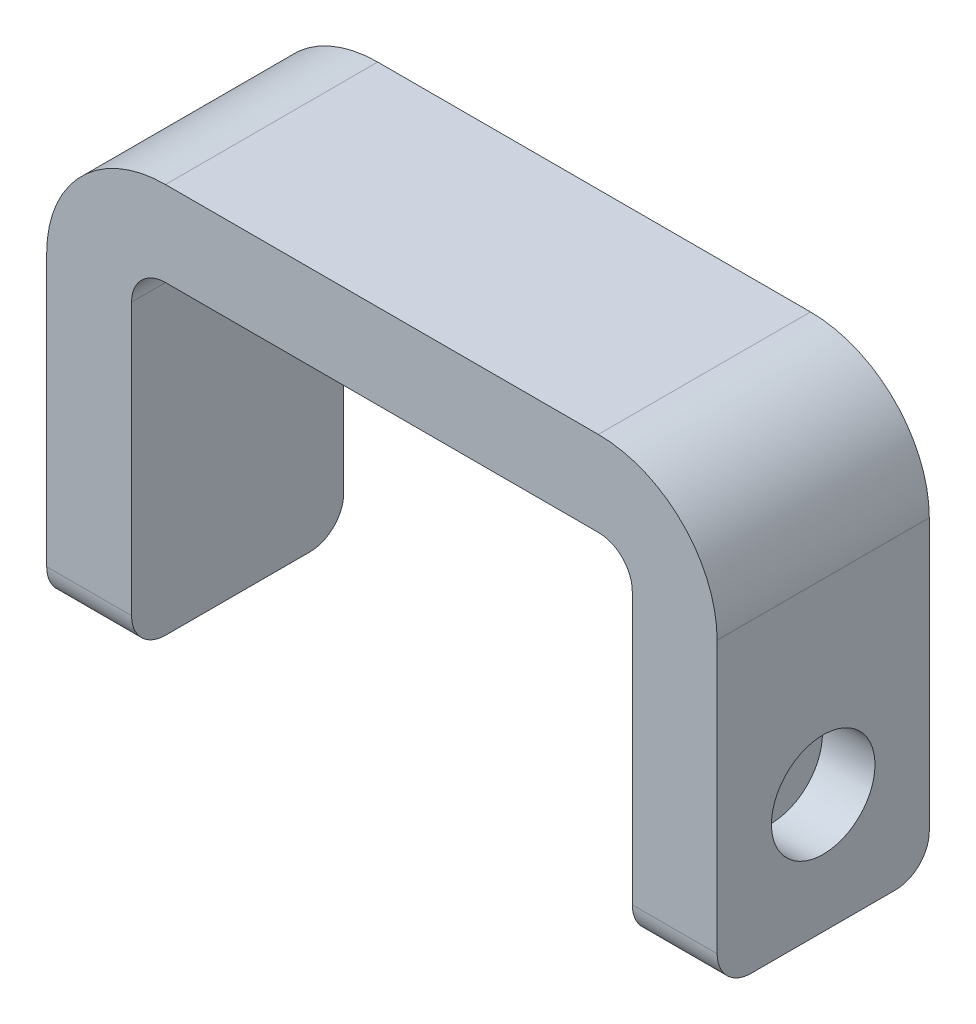
ISO-10303-21;
HEADER;
FILE_DESCRIPTION(('STEP AP214'),'2;1');
FILE_NAME('part.step','',(''),(''),'','','');
FILE_SCHEMA(('AUTOMOTIVE_DESIGN { 1 0 10303 214 1 1 1 1 }'));
ENDSEC;
DATA;
#1=APPLICATION_CONTEXT('core data for automotive mechanical design processes');
#2=APPLICATION_PROTOCOL_DEFINITION('international standard','automotive_design',2000,#1);
#3=PRODUCT_CONTEXT('',#1,'mechanical');
#4=PRODUCT('Part','Part','',(#3));
#5=PRODUCT_RELATED_PRODUCT_CATEGORY('part','',(#4));
#6=PRODUCT_DEFINITION_FORMATION('','',#4);
#7=PRODUCT_DEFINITION_CONTEXT('part definition',#1,'design');
#8=PRODUCT_DEFINITION('design','',#6,#7);
#9=PRODUCT_DEFINITION_SHAPE('','',#8);
#10=(LENGTH_UNIT() NAMED_UNIT(*) SI_UNIT(.MILLI.,.METRE.));
#11=(NAMED_UNIT(*) PLANE_ANGLE_UNIT() SI_UNIT($,.RADIAN.));
#12=(NAMED_UNIT(*) SI_UNIT($,.STERADIAN.) SOLID_ANGLE_UNIT());
#13=UNCERTAINTY_MEASURE_WITH_UNIT(LENGTH_MEASURE(1.E-05),#10,'distance_accuracy_value','');
#14=(GEOMETRIC_REPRESENTATION_CONTEXT(3) GLOBAL_UNCERTAINTY_ASSIGNED_CONTEXT((#13)) GLOBAL_UNIT_ASSIGNED_CONTEXT((#10,
#11,#12)) REPRESENTATION_CONTEXT('',''));
#15=CARTESIAN_POINT('',(0.,0.,0.));
#16=DIRECTION('',(0.,0.,1.));
#17=DIRECTION('',(1.,0.,0.));
#18=AXIS2_PLACEMENT_3D('',#15,#16,#17);
#19=CARTESIAN_POINT('',(-14.75,0.,6.25));
#20=DIRECTION('',(-1.,0.,0.));
#21=DIRECTION('',(0.,0.,1.));
#22=AXIS2_PLACEMENT_3D('',#19,#20,#21);
#23=PLANE('',#22);
#24=DIRECTION('',(0.,0.,-1.));
#25=VECTOR('',#24,1.);
#26=CARTESIAN_POINT('',(-14.75,0.,6.25));
#27=LINE('',#26,#25);
#28=CARTESIAN_POINT('',(-14.75,0.,4.25));
#29=VERTEX_POINT('',#28);
#30=CARTESIAN_POINT('',(-14.75,0.,-4.25));
#31=VERTEX_POINT('',#30);
#32=EDGE_CURVE('E198',#29,#31,#27,.T.);
#33=ORIENTED_EDGE('',*,*,#32,.T.);
#34=CARTESIAN_POINT('',(-14.75,2.,-4.25));
#35=DIRECTION('',(-1.,0.,0.));
#36=DIRECTION('',(0.,0.,1.));
#37=AXIS2_PLACEMENT_3D('',#34,#35,#36);
#38=CIRCLE('',#37,2.);
#39=CARTESIAN_POINT('',(-14.75,2.,-6.25));
#40=VERTEX_POINT('',#39);
#41=EDGE_CURVE('E268',#31,#40,#38,.F.);
#42=ORIENTED_EDGE('',*,*,#41,.T.);
#43=DIRECTION('',(0.,1.,0.));
#44=VECTOR('',#43,1.);
#45=CARTESIAN_POINT('',(-14.75,0.,-6.25));
#46=LINE('',#45,#44);
#47=CARTESIAN_POINT('',(-14.75,18.,-6.25));
#48=VERTEX_POINT('',#47);
#49=EDGE_CURVE('E189',#40,#48,#46,.T.);
#50=ORIENTED_EDGE('',*,*,#49,.T.);
#51=DIRECTION('',(0.,0.,-1.));
#52=VECTOR('',#51,1.);
#53=CARTESIAN_POINT('',(-14.75,18.,6.25));
#54=LINE('',#53,#52);
#55=CARTESIAN_POINT('',(-14.75,18.,6.25));
#56=VERTEX_POINT('',#55);
#57=EDGE_CURVE('E167',#48,#56,#54,.F.);
#58=ORIENTED_EDGE('',*,*,#57,.T.);
#59=DIRECTION('',(0.,1.,0.));
#60=VECTOR('',#59,1.);
#61=CARTESIAN_POINT('',(-14.75,0.,6.25));
#62=LINE('',#61,#60);
#63=CARTESIAN_POINT('',(-14.75,2.,6.25));
#64=VERTEX_POINT('',#63);
#65=EDGE_CURVE('E197',#64,#56,#62,.T.);
#66=ORIENTED_EDGE('',*,*,#65,.F.);
#67=CARTESIAN_POINT('',(-14.75,2.,4.25));
#68=DIRECTION('',(-1.,0.,0.));
#69=DIRECTION('',(0.,0.,1.));
#70=AXIS2_PLACEMENT_3D('',#67,#68,#69);
#71=CIRCLE('',#70,2.);
#72=EDGE_CURVE('E266',#64,#29,#71,.F.);
#73=ORIENTED_EDGE('',*,*,#72,.T.);
#74=EDGE_LOOP('',(#33,#42,#50,#58,#66,#73));
#75=FACE_BOUND('',#74,.T.);
#76=ADVANCED_FACE('F43',(#75),#23,.F.);
#77=CARTESIAN_POINT('',(-14.75,20.,6.25));
#78=DIRECTION('',(0.,1.,0.));
#79=DIRECTION('',(0.,0.,1.));
#80=AXIS2_PLACEMENT_3D('',#77,#78,#79);
#81=PLANE('',#80);
#82=DIRECTION('',(1.,0.,0.));
#83=VECTOR('',#82,1.);
#84=CARTESIAN_POINT('',(-14.75,20.,-6.25));
#85=LINE('',#84,#83);
#86=CARTESIAN_POINT('',(-12.75,20.,-6.25));
#87=VERTEX_POINT('',#86);
#88=CARTESIAN_POINT('',(12.75,20.,-6.25));
#89=VERTEX_POINT('',#88);
#90=EDGE_CURVE('E185',#87,#89,#85,.T.);
#91=ORIENTED_EDGE('',*,*,#90,.T.);
#92=DIRECTION('',(0.,0.,-1.));
#93=VECTOR('',#92,1.);
#94=CARTESIAN_POINT('',(12.75,20.,6.25));
#95=LINE('',#94,#93);
#96=CARTESIAN_POINT('',(12.75,20.,6.25));
#97=VERTEX_POINT('',#96);
#98=EDGE_CURVE('E161',#89,#97,#95,.F.);
#99=ORIENTED_EDGE('',*,*,#98,.T.);
#100=DIRECTION('',(1.,0.,0.));
#101=VECTOR('',#100,1.);
#102=CARTESIAN_POINT('',(-14.75,20.,6.25));
#103=LINE('',#102,#101);
#104=CARTESIAN_POINT('',(-12.75,20.,6.25));
#105=VERTEX_POINT('',#104);
#106=EDGE_CURVE('E301',#105,#97,#103,.T.);
#107=ORIENTED_EDGE('',*,*,#106,.F.);
#108=DIRECTION('',(0.,0.,-1.));
#109=VECTOR('',#108,1.);
#110=CARTESIAN_POINT('',(-12.75,20.,-6.25));
#111=LINE('',#110,#109);
#112=EDGE_CURVE('E177',#105,#87,#111,.T.);
#113=ORIENTED_EDGE('',*,*,#112,.T.);
#114=EDGE_LOOP('',(#91,#99,#107,#113));
#115=FACE_BOUND('',#114,.T.);
#116=ADVANCED_FACE('F330',(#115),#81,.F.);
#117=CARTESIAN_POINT('',(14.75,0.,6.25));
#118=DIRECTION('',(1.,0.,0.));
#119=DIRECTION('',(0.,0.,-1.));
#120=AXIS2_PLACEMENT_3D('',#117,#118,#119);
#121=PLANE('',#120);
#122=DIRECTION('',(0.,-1.,0.));
#123=VECTOR('',#122,1.);
#124=CARTESIAN_POINT('',(14.75,0.,-6.25));
#125=LINE('',#124,#123);
#126=CARTESIAN_POINT('',(14.75,18.,-6.25));
#127=VERTEX_POINT('',#126);
#128=CARTESIAN_POINT('',(14.75,2.,-6.25));
#129=VERTEX_POINT('',#128);
#130=EDGE_CURVE('E173',#127,#129,#125,.T.);
#131=ORIENTED_EDGE('',*,*,#130,.T.);
#132=CARTESIAN_POINT('',(14.75,2.,-4.25));
#133=DIRECTION('',(1.,0.,0.));
#134=DIRECTION('',(0.,0.,-1.));
#135=AXIS2_PLACEMENT_3D('',#132,#133,#134);
#136=CIRCLE('',#135,2.);
#137=CARTESIAN_POINT('',(14.75,0.,-4.25));
#138=VERTEX_POINT('',#137);
#139=EDGE_CURVE('E254',#129,#138,#136,.F.);
#140=ORIENTED_EDGE('',*,*,#139,.T.);
#141=DIRECTION('',(0.,0.,-1.));
#142=VECTOR('',#141,1.);
#143=CARTESIAN_POINT('',(14.75,0.,6.25));
#144=LINE('',#143,#142);
#145=CARTESIAN_POINT('',(14.75,0.,4.25));
#146=VERTEX_POINT('',#145);
#147=EDGE_CURVE('E178',#146,#138,#144,.T.);
#148=ORIENTED_EDGE('',*,*,#147,.F.);
#149=CARTESIAN_POINT('',(14.75,2.,4.25));
#150=DIRECTION('',(1.,0.,0.));
#151=DIRECTION('',(0.,0.,-1.));
#152=AXIS2_PLACEMENT_3D('',#149,#150,#151);
#153=CIRCLE('',#152,2.);
#154=CARTESIAN_POINT('',(14.75,2.,6.25));
#155=VERTEX_POINT('',#154);
#156=EDGE_CURVE('E252',#146,#155,#153,.F.);
#157=ORIENTED_EDGE('',*,*,#156,.T.);
#158=DIRECTION('',(0.,-1.,0.));
#159=VECTOR('',#158,1.);
#160=CARTESIAN_POINT('',(14.75,0.,6.25));
#161=LINE('',#160,#159);
#162=CARTESIAN_POINT('',(14.75,18.,6.25));
#163=VERTEX_POINT('',#162);
#164=EDGE_CURVE('E176',#163,#155,#161,.T.);
#165=ORIENTED_EDGE('',*,*,#164,.F.);
#166=DIRECTION('',(0.,0.,-1.));
#167=VECTOR('',#166,1.);
#168=CARTESIAN_POINT('',(14.75,18.,-6.25));
#169=LINE('',#168,#167);
#170=EDGE_CURVE('E160',#163,#127,#169,.T.);
#171=ORIENTED_EDGE('',*,*,#170,.T.);
#172=EDGE_LOOP('',(#131,#140,#148,#157,#165,#171));
#173=FACE_BOUND('',#172,.T.);
#174=ADVANCED_FACE('F172',(#173),#121,.F.);
#175=CARTESIAN_POINT('',(14.75,0.,6.25));
#176=DIRECTION('',(0.,1.,0.));
#177=DIRECTION('',(-1.,0.,0.));
#178=AXIS2_PLACEMENT_3D('',#175,#176,#177);
#179=PLANE('',#178);
#180=ORIENTED_EDGE('',*,*,#147,.T.);
#181=DIRECTION('',(1.,0.,0.));
#182=VECTOR('',#181,1.);
#183=CARTESIAN_POINT('',(19.75,0.,-4.25));
#184=LINE('',#183,#182);
#185=CARTESIAN_POINT('',(19.75,0.,-4.25));
#186=VERTEX_POINT('',#185);
#187=EDGE_CURVE('E242',#138,#186,#184,.T.);
#188=ORIENTED_EDGE('',*,*,#187,.T.);
#189=DIRECTION('',(0.,0.,-1.));
#190=VECTOR('',#189,1.);
#191=CARTESIAN_POINT('',(19.75,0.,6.25));
#192=LINE('',#191,#190);
#193=CARTESIAN_POINT('',(19.75,0.,4.25));
#194=VERTEX_POINT('',#193);
#195=EDGE_CURVE('E204',#194,#186,#192,.T.);
#196=ORIENTED_EDGE('',*,*,#195,.F.);
#197=DIRECTION('',(1.,0.,0.));
#198=VECTOR('',#197,1.);
#199=CARTESIAN_POINT('',(14.75,0.,4.25));
#200=LINE('',#199,#198);
#201=EDGE_CURVE('E240',#194,#146,#200,.F.);
#202=ORIENTED_EDGE('',*,*,#201,.T.);
#203=EDGE_LOOP('',(#180,#188,#196,#202));
#204=FACE_BOUND('',#203,.T.);
#205=ADVANCED_FACE('F486',(#204),#179,.F.);
#206=CARTESIAN_POINT('',(19.75,0.,6.25));
#207=DIRECTION('',(-1.,0.,0.));
#208=DIRECTION('',(0.,0.,1.));
#209=AXIS2_PLACEMENT_3D('',#206,#207,#208);
#210=PLANE('',#209);
#211=CARTESIAN_POINT('',(19.75,7.,0.));
#212=DIRECTION('',(-1.,0.,0.));
#213=DIRECTION('',(0.,0.,1.));
#214=AXIS2_PLACEMENT_3D('',#211,#212,#213);
#215=CIRCLE('',#214,3.05);
#216=CARTESIAN_POINT('',(19.75,7.,3.05));
#217=VERTEX_POINT('',#216);
#218=EDGE_CURVE('E308',#217,#217,#215,.T.);
#219=ORIENTED_EDGE('',*,*,#218,.T.);
#220=EDGE_LOOP('',(#219));
#221=FACE_BOUND('',#220,.T.);
#222=ORIENTED_EDGE('',*,*,#195,.T.);
#223=CARTESIAN_POINT('',(19.75,2.,-4.25));
#224=DIRECTION('',(-1.,0.,0.));
#225=DIRECTION('',(0.,0.,1.));
#226=AXIS2_PLACEMENT_3D('',#223,#224,#225);
#227=CIRCLE('',#226,2.);
#228=CARTESIAN_POINT('',(19.75,2.,-6.25));
#229=VERTEX_POINT('',#228);
#230=EDGE_CURVE('E247',#186,#229,#227,.F.);
#231=ORIENTED_EDGE('',*,*,#230,.T.);
#232=DIRECTION('',(0.,1.,0.));
#233=VECTOR('',#232,1.);
#234=CARTESIAN_POINT('',(19.75,0.,-6.25));
#235=LINE('',#234,#233);
#236=CARTESIAN_POINT('',(19.75,18.,-6.25));
#237=VERTEX_POINT('',#236);
#238=EDGE_CURVE('E184',#229,#237,#235,.T.);
#239=ORIENTED_EDGE('',*,*,#238,.T.);
#240=DIRECTION('',(0.,0.,-1.));
#241=VECTOR('',#240,1.);
#242=CARTESIAN_POINT('',(19.75,18.,6.25));
#243=LINE('',#242,#241);
#244=CARTESIAN_POINT('',(19.75,18.,6.25));
#245=VERTEX_POINT('',#244);
#246=EDGE_CURVE('E230',#237,#245,#243,.F.);
#247=ORIENTED_EDGE('',*,*,#246,.T.);
#248=DIRECTION('',(0.,1.,0.));
#249=VECTOR('',#248,1.);
#250=CARTESIAN_POINT('',(19.75,0.,6.25));
#251=LINE('',#250,#249);
#252=CARTESIAN_POINT('',(19.75,2.,6.25));
#253=VERTEX_POINT('',#252);
#254=EDGE_CURVE('E298',#253,#245,#251,.T.);
#255=ORIENTED_EDGE('',*,*,#254,.F.);
#256=CARTESIAN_POINT('',(19.75,2.,4.25));
#257=DIRECTION('',(-1.,0.,0.));
#258=DIRECTION('',(0.,0.,1.));
#259=AXIS2_PLACEMENT_3D('',#256,#257,#258);
#260=CIRCLE('',#259,2.);
#261=EDGE_CURVE('E245',#253,#194,#260,.F.);
#262=ORIENTED_EDGE('',*,*,#261,.T.);
#263=EDGE_LOOP('',(#222,#231,#239,#247,#255,#262));
#264=FACE_BOUND('',#263,.T.);
#265=ADVANCED_FACE('F477',(#221,#264),#210,.F.);
#266=CARTESIAN_POINT('',(-19.75,25.,6.25));
#267=DIRECTION('',(0.,-1.,0.));
#268=DIRECTION('',(0.,0.,-1.));
#269=AXIS2_PLACEMENT_3D('',#266,#267,#268);
#270=PLANE('',#269);
#271=DIRECTION('',(-1.,0.,0.));
#272=VECTOR('',#271,1.);
#273=CARTESIAN_POINT('',(-19.75,25.,6.25));
#274=LINE('',#273,#272);
#275=CARTESIAN_POINT('',(12.75,25.,6.25));
#276=VERTEX_POINT('',#275);
#277=CARTESIAN_POINT('',(-12.75,25.,6.25));
#278=VERTEX_POINT('',#277);
#279=EDGE_CURVE('E281',#276,#278,#274,.T.);
#280=ORIENTED_EDGE('',*,*,#279,.F.);
#281=DIRECTION('',(0.,0.,-1.));
#282=VECTOR('',#281,1.);
#283=CARTESIAN_POINT('',(12.75,25.,6.25));
#284=LINE('',#283,#282);
#285=CARTESIAN_POINT('',(12.75,25.,-6.25));
#286=VERTEX_POINT('',#285);
#287=EDGE_CURVE('E222',#276,#286,#284,.T.);
#288=ORIENTED_EDGE('',*,*,#287,.T.);
#289=DIRECTION('',(-1.,0.,0.));
#290=VECTOR('',#289,1.);
#291=CARTESIAN_POINT('',(-19.75,25.,-6.25));
#292=LINE('',#291,#290);
#293=CARTESIAN_POINT('',(-12.75,25.,-6.25));
#294=VERTEX_POINT('',#293);
#295=EDGE_CURVE('E187',#286,#294,#292,.T.);
#296=ORIENTED_EDGE('',*,*,#295,.T.);
#297=DIRECTION('',(0.,0.,-1.));
#298=VECTOR('',#297,1.);
#299=CARTESIAN_POINT('',(-12.75,25.,6.25));
#300=LINE('',#299,#298);
#301=EDGE_CURVE('E220',#294,#278,#300,.F.);
#302=ORIENTED_EDGE('',*,*,#301,.T.);
#303=EDGE_LOOP('',(#280,#288,#296,#302));
#304=FACE_BOUND('',#303,.T.);
#305=ADVANCED_FACE('F467',(#304),#270,.F.);
#306=CARTESIAN_POINT('',(-19.75,0.,6.25));
#307=DIRECTION('',(1.,0.,0.));
#308=DIRECTION('',(0.,0.,-1.));
#309=AXIS2_PLACEMENT_3D('',#306,#307,#308);
#310=PLANE('',#309);
#311=CARTESIAN_POINT('',(-19.75,7.,0.));
#312=DIRECTION('',(-1.,0.,0.));
#313=DIRECTION('',(0.,0.,1.));
#314=AXIS2_PLACEMENT_3D('',#311,#312,#313);
#315=CIRCLE('',#314,3.05);
#316=CARTESIAN_POINT('',(-19.75,7.,3.05));
#317=VERTEX_POINT('',#316);
#318=EDGE_CURVE('E294',#317,#317,#315,.T.);
#319=ORIENTED_EDGE('',*,*,#318,.F.);
#320=EDGE_LOOP('',(#319));
#321=FACE_BOUND('',#320,.T.);
#322=DIRECTION('',(0.,-1.,0.));
#323=VECTOR('',#322,1.);
#324=CARTESIAN_POINT('',(-19.75,0.,-6.25));
#325=LINE('',#324,#323);
#326=CARTESIAN_POINT('',(-19.75,18.,-6.25));
#327=VERTEX_POINT('',#326);
#328=CARTESIAN_POINT('',(-19.75,2.,-6.25));
#329=VERTEX_POINT('',#328);
#330=EDGE_CURVE('E195',#327,#329,#325,.T.);
#331=ORIENTED_EDGE('',*,*,#330,.T.);
#332=CARTESIAN_POINT('',(-19.75,2.,-4.25));
#333=DIRECTION('',(1.,0.,0.));
#334=DIRECTION('',(0.,0.,-1.));
#335=AXIS2_PLACEMENT_3D('',#332,#333,#334);
#336=CIRCLE('',#335,2.);
#337=CARTESIAN_POINT('',(-19.75,0.,-4.25));
#338=VERTEX_POINT('',#337);
#339=EDGE_CURVE('E11',#329,#338,#336,.F.);
#340=ORIENTED_EDGE('',*,*,#339,.T.);
#341=DIRECTION('',(0.,0.,-1.));
#342=VECTOR('',#341,1.);
#343=CARTESIAN_POINT('',(-19.75,0.,6.25));
#344=LINE('',#343,#342);
#345=CARTESIAN_POINT('',(-19.75,0.,4.25));
#346=VERTEX_POINT('',#345);
#347=EDGE_CURVE('E201',#346,#338,#344,.T.);
#348=ORIENTED_EDGE('',*,*,#347,.F.);
#349=CARTESIAN_POINT('',(-19.75,2.,4.25));
#350=DIRECTION('',(1.,0.,0.));
#351=DIRECTION('',(0.,0.,-1.));
#352=AXIS2_PLACEMENT_3D('',#349,#350,#351);
#353=CIRCLE('',#352,2.);
#354=CARTESIAN_POINT('',(-19.75,2.,6.25));
#355=VERTEX_POINT('',#354);
#356=EDGE_CURVE('E51',#346,#355,#353,.F.);
#357=ORIENTED_EDGE('',*,*,#356,.T.);
#358=DIRECTION('',(0.,-1.,0.));
#359=VECTOR('',#358,1.);
#360=CARTESIAN_POINT('',(-19.75,0.,6.25));
#361=LINE('',#360,#359);
#362=CARTESIAN_POINT('',(-19.75,18.,6.25));
#363=VERTEX_POINT('',#362);
#364=EDGE_CURVE('E202',#363,#355,#361,.T.);
#365=ORIENTED_EDGE('',*,*,#364,.F.);
#366=DIRECTION('',(0.,0.,-1.));
#367=VECTOR('',#366,1.);
#368=CARTESIAN_POINT('',(-19.75,18.,6.25));
#369=LINE('',#368,#367);
#370=EDGE_CURVE('E237',#363,#327,#369,.T.);
#371=ORIENTED_EDGE('',*,*,#370,.T.);
#372=EDGE_LOOP('',(#331,#340,#348,#357,#365,#371));
#373=FACE_BOUND('',#372,.T.);
#374=ADVANCED_FACE('F272',(#321,#373),#310,.F.);
#375=CARTESIAN_POINT('',(-14.75,0.,6.25));
#376=DIRECTION('',(0.,1.,0.));
#377=DIRECTION('',(-1.,0.,0.));
#378=AXIS2_PLACEMENT_3D('',#375,#376,#377);
#379=PLANE('',#378);
#380=ORIENTED_EDGE('',*,*,#347,.T.);
#381=DIRECTION('',(1.,0.,0.));
#382=VECTOR('',#381,1.);
#383=CARTESIAN_POINT('',(-14.75,0.,-4.25));
#384=LINE('',#383,#382);
#385=EDGE_CURVE('E263',#338,#31,#384,.T.);
#386=ORIENTED_EDGE('',*,*,#385,.T.);
#387=ORIENTED_EDGE('',*,*,#32,.F.);
#388=DIRECTION('',(1.,0.,0.));
#389=VECTOR('',#388,1.);
#390=CARTESIAN_POINT('',(-14.75,0.,4.25));
#391=LINE('',#390,#389);
#392=EDGE_CURVE('E63',#29,#346,#391,.F.);
#393=ORIENTED_EDGE('',*,*,#392,.T.);
#394=EDGE_LOOP('',(#380,#386,#387,#393));
#395=FACE_BOUND('',#394,.T.);
#396=ADVANCED_FACE('F284',(#395),#379,.F.);
#397=CARTESIAN_POINT('',(0.,0.,6.25));
#398=DIRECTION('',(0.,0.,-1.));
#399=DIRECTION('',(-1.,0.,0.));
#400=AXIS2_PLACEMENT_3D('',#397,#398,#399);
#401=PLANE('',#400);
#402=ORIENTED_EDGE('',*,*,#164,.T.);
#403=DIRECTION('',(1.,0.,0.));
#404=VECTOR('',#403,1.);
#405=CARTESIAN_POINT('',(0.,2.,6.25));
#406=LINE('',#405,#404);
#407=EDGE_CURVE('E259',#155,#253,#406,.T.);
#408=ORIENTED_EDGE('',*,*,#407,.T.);
#409=ORIENTED_EDGE('',*,*,#254,.T.);
#410=CARTESIAN_POINT('',(12.75,18.,6.25));
#411=DIRECTION('',(0.,0.,-1.));
#412=DIRECTION('',(-1.,0.,0.));
#413=AXIS2_PLACEMENT_3D('',#410,#411,#412);
#414=CIRCLE('',#413,7.);
#415=EDGE_CURVE('E235',#245,#276,#414,.F.);
#416=ORIENTED_EDGE('',*,*,#415,.T.);
#417=ORIENTED_EDGE('',*,*,#279,.T.);
#418=CARTESIAN_POINT('',(-12.75,18.,6.25));
#419=DIRECTION('',(0.,0.,-1.));
#420=DIRECTION('',(-1.,0.,0.));
#421=AXIS2_PLACEMENT_3D('',#418,#419,#420);
#422=CIRCLE('',#421,7.);
#423=EDGE_CURVE('E233',#278,#363,#422,.F.);
#424=ORIENTED_EDGE('',*,*,#423,.T.);
#425=ORIENTED_EDGE('',*,*,#364,.T.);
#426=DIRECTION('',(1.,0.,0.));
#427=VECTOR('',#426,1.);
#428=CARTESIAN_POINT('',(0.,2.,6.25));
#429=LINE('',#428,#427);
#430=EDGE_CURVE('E256',#355,#64,#429,.T.);
#431=ORIENTED_EDGE('',*,*,#430,.T.);
#432=ORIENTED_EDGE('',*,*,#65,.T.);
#433=CARTESIAN_POINT('',(-12.75,18.,6.25));
#434=DIRECTION('',(0.,0.,-1.));
#435=DIRECTION('',(-1.,0.,0.));
#436=AXIS2_PLACEMENT_3D('',#433,#434,#435);
#437=CIRCLE('',#436,2.);
#438=EDGE_CURVE('E218',#56,#105,#437,.T.);
#439=ORIENTED_EDGE('',*,*,#438,.T.);
#440=ORIENTED_EDGE('',*,*,#106,.T.);
#441=CARTESIAN_POINT('',(12.75,18.,6.25));
#442=DIRECTION('',(0.,0.,-1.));
#443=DIRECTION('',(-1.,0.,0.));
#444=AXIS2_PLACEMENT_3D('',#441,#442,#443);
#445=CIRCLE('',#444,2.);
#446=EDGE_CURVE('E166',#97,#163,#445,.T.);
#447=ORIENTED_EDGE('',*,*,#446,.T.);
#448=EDGE_LOOP('',(#402,#408,#409,#416,#417,#424,#425,#431,#432,#439,#440,#447));
#449=FACE_BOUND('',#448,.T.);
#450=ADVANCED_FACE('F277',(#449),#401,.F.);
#451=CARTESIAN_POINT('',(0.,0.,-6.25));
#452=DIRECTION('',(0.,0.,-1.));
#453=DIRECTION('',(-1.,0.,0.));
#454=AXIS2_PLACEMENT_3D('',#451,#452,#453);
#455=PLANE('',#454);
#456=ORIENTED_EDGE('',*,*,#238,.F.);
#457=DIRECTION('',(1.,0.,0.));
#458=VECTOR('',#457,1.);
#459=CARTESIAN_POINT('',(14.75,2.,-6.25));
#460=LINE('',#459,#458);
#461=EDGE_CURVE('E183',#229,#129,#460,.F.);
#462=ORIENTED_EDGE('',*,*,#461,.T.);
#463=ORIENTED_EDGE('',*,*,#130,.F.);
#464=CARTESIAN_POINT('',(12.75,18.,-6.25));
#465=DIRECTION('',(0.,0.,-1.));
#466=DIRECTION('',(-1.,0.,0.));
#467=AXIS2_PLACEMENT_3D('',#464,#465,#466);
#468=CIRCLE('',#467,2.);
#469=EDGE_CURVE('E156',#127,#89,#468,.F.);
#470=ORIENTED_EDGE('',*,*,#469,.T.);
#471=ORIENTED_EDGE('',*,*,#90,.F.);
#472=CARTESIAN_POINT('',(-12.75,18.,-6.25));
#473=DIRECTION('',(0.,0.,-1.));
#474=DIRECTION('',(-1.,0.,0.));
#475=AXIS2_PLACEMENT_3D('',#472,#473,#474);
#476=CIRCLE('',#475,2.);
#477=EDGE_CURVE('E215',#87,#48,#476,.F.);
#478=ORIENTED_EDGE('',*,*,#477,.T.);
#479=ORIENTED_EDGE('',*,*,#49,.F.);
#480=DIRECTION('',(1.,0.,0.));
#481=VECTOR('',#480,1.);
#482=CARTESIAN_POINT('',(-19.75,2.,-6.25));
#483=LINE('',#482,#481);
#484=EDGE_CURVE('E249',#40,#329,#483,.F.);
#485=ORIENTED_EDGE('',*,*,#484,.T.);
#486=ORIENTED_EDGE('',*,*,#330,.F.);
#487=CARTESIAN_POINT('',(-12.75,18.,-6.25));
#488=DIRECTION('',(0.,0.,-1.));
#489=DIRECTION('',(-1.,0.,0.));
#490=AXIS2_PLACEMENT_3D('',#487,#488,#489);
#491=CIRCLE('',#490,7.);
#492=EDGE_CURVE('E225',#327,#294,#491,.T.);
#493=ORIENTED_EDGE('',*,*,#492,.T.);
#494=ORIENTED_EDGE('',*,*,#295,.F.);
#495=CARTESIAN_POINT('',(12.75,18.,-6.25));
#496=DIRECTION('',(0.,0.,-1.));
#497=DIRECTION('',(-1.,0.,0.));
#498=AXIS2_PLACEMENT_3D('',#495,#496,#497);
#499=CIRCLE('',#498,7.);
#500=EDGE_CURVE('E227',#286,#237,#499,.T.);
#501=ORIENTED_EDGE('',*,*,#500,.T.);
#502=EDGE_LOOP('',(#456,#462,#463,#470,#471,#478,#479,#485,#486,#493,#494,#501));
#503=FACE_BOUND('',#502,.T.);
#504=ADVANCED_FACE('F181',(#503),#455,.T.);
#505=CARTESIAN_POINT('',(-16.65,7.,0.));
#506=DIRECTION('',(-1.,0.,0.));
#507=DIRECTION('',(0.,0.,1.));
#508=AXIS2_PLACEMENT_3D('',#505,#506,#507);
#509=CYLINDRICAL_SURFACE('',#508,3.05);
#510=CARTESIAN_POINT('',(-16.65,7.,0.));
#511=DIRECTION('',(-1.,0.,0.));
#512=DIRECTION('',(0.,0.,1.));
#513=AXIS2_PLACEMENT_3D('',#510,#511,#512);
#514=CIRCLE('',#513,3.05);
#515=CARTESIAN_POINT('',(-16.65,7.,3.05));
#516=VERTEX_POINT('',#515);
#517=EDGE_CURVE('E292',#516,#516,#514,.T.);
#518=ORIENTED_EDGE('',*,*,#517,.F.);
#519=EDGE_LOOP('',(#518));
#520=FACE_BOUND('',#519,.T.);
#521=ORIENTED_EDGE('',*,*,#318,.T.);
#522=EDGE_LOOP('',(#521));
#523=FACE_BOUND('',#522,.T.);
#524=ADVANCED_FACE('F425',(#520,#523),#509,.F.);
#525=CARTESIAN_POINT('',(-16.65,7.,0.));
#526=DIRECTION('',(-1.,0.,0.));
#527=DIRECTION('',(0.,0.,1.));
#528=AXIS2_PLACEMENT_3D('',#525,#526,#527);
#529=PLANE('',#528);
#530=ORIENTED_EDGE('',*,*,#517,.T.);
#531=EDGE_LOOP('',(#530));
#532=FACE_BOUND('',#531,.T.);
#533=ADVANCED_FACE('F327',(#532),#529,.T.);
#534=CARTESIAN_POINT('',(16.65,7.,0.));
#535=DIRECTION('',(1.,0.,0.));
#536=DIRECTION('',(0.,0.,-1.));
#537=AXIS2_PLACEMENT_3D('',#534,#535,#536);
#538=CYLINDRICAL_SURFACE('',#537,3.05);
#539=CARTESIAN_POINT('',(16.65,7.,0.));
#540=DIRECTION('',(-1.,0.,0.));
#541=DIRECTION('',(0.,0.,1.));
#542=AXIS2_PLACEMENT_3D('',#539,#540,#541);
#543=CIRCLE('',#542,3.05);
#544=CARTESIAN_POINT('',(16.65,7.,3.05));
#545=VERTEX_POINT('',#544);
#546=EDGE_CURVE('E306',#545,#545,#543,.T.);
#547=ORIENTED_EDGE('',*,*,#546,.T.);
#548=EDGE_LOOP('',(#547));
#549=FACE_BOUND('',#548,.T.);
#550=ORIENTED_EDGE('',*,*,#218,.F.);
#551=EDGE_LOOP('',(#550));
#552=FACE_BOUND('',#551,.T.);
#553=ADVANCED_FACE('F314',(#549,#552),#538,.F.);
#554=CARTESIAN_POINT('',(16.65,7.,0.));
#555=DIRECTION('',(1.,0.,0.));
#556=DIRECTION('',(0.,0.,1.));
#557=AXIS2_PLACEMENT_3D('',#554,#555,#556);
#558=PLANE('',#557);
#559=ORIENTED_EDGE('',*,*,#546,.F.);
#560=EDGE_LOOP('',(#559));
#561=FACE_BOUND('',#560,.T.);
#562=ADVANCED_FACE('F317',(#561),#558,.T.);
#563=CARTESIAN_POINT('',(12.75,18.,6.25));
#564=DIRECTION('',(0.,0.,1.));
#565=DIRECTION('',(1.,0.,0.));
#566=AXIS2_PLACEMENT_3D('',#563,#564,#565);
#567=CYLINDRICAL_SURFACE('',#566,2.);
#568=ORIENTED_EDGE('',*,*,#446,.F.);
#569=ORIENTED_EDGE('',*,*,#98,.F.);
#570=ORIENTED_EDGE('',*,*,#469,.F.);
#571=ORIENTED_EDGE('',*,*,#170,.F.);
#572=EDGE_LOOP('',(#568,#569,#570,#571));
#573=FACE_BOUND('',#572,.T.);
#574=ADVANCED_FACE('F159',(#573),#567,.F.);
#575=CARTESIAN_POINT('',(-12.75,18.,6.25));
#576=DIRECTION('',(0.,0.,1.));
#577=DIRECTION('',(1.,0.,0.));
#578=AXIS2_PLACEMENT_3D('',#575,#576,#577);
#579=CYLINDRICAL_SURFACE('',#578,2.);
#580=ORIENTED_EDGE('',*,*,#438,.F.);
#581=ORIENTED_EDGE('',*,*,#57,.F.);
#582=ORIENTED_EDGE('',*,*,#477,.F.);
#583=ORIENTED_EDGE('',*,*,#112,.F.);
#584=EDGE_LOOP('',(#580,#581,#582,#583));
#585=FACE_BOUND('',#584,.T.);
#586=ADVANCED_FACE('F325',(#585),#579,.F.);
#587=CARTESIAN_POINT('',(12.75,18.,6.25));
#588=DIRECTION('',(0.,0.,-1.));
#589=DIRECTION('',(-1.,0.,0.));
#590=AXIS2_PLACEMENT_3D('',#587,#588,#589);
#591=CYLINDRICAL_SURFACE('',#590,7.);
#592=ORIENTED_EDGE('',*,*,#415,.F.);
#593=ORIENTED_EDGE('',*,*,#246,.F.);
#594=ORIENTED_EDGE('',*,*,#500,.F.);
#595=ORIENTED_EDGE('',*,*,#287,.F.);
#596=EDGE_LOOP('',(#592,#593,#594,#595));
#597=FACE_BOUND('',#596,.T.);
#598=ADVANCED_FACE('F342',(#597),#591,.T.);
#599=CARTESIAN_POINT('',(-12.75,18.,6.25));
#600=DIRECTION('',(0.,0.,-1.));
#601=DIRECTION('',(-1.,0.,0.));
#602=AXIS2_PLACEMENT_3D('',#599,#600,#601);
#603=CYLINDRICAL_SURFACE('',#602,7.);
#604=ORIENTED_EDGE('',*,*,#423,.F.);
#605=ORIENTED_EDGE('',*,*,#301,.F.);
#606=ORIENTED_EDGE('',*,*,#492,.F.);
#607=ORIENTED_EDGE('',*,*,#370,.F.);
#608=EDGE_LOOP('',(#604,#605,#606,#607));
#609=FACE_BOUND('',#608,.T.);
#610=ADVANCED_FACE('F346',(#609),#603,.T.);
#611=CARTESIAN_POINT('',(14.75,2.,-4.25));
#612=DIRECTION('',(-1.,0.,0.));
#613=DIRECTION('',(0.,-1.,0.));
#614=AXIS2_PLACEMENT_3D('',#611,#612,#613);
#615=CYLINDRICAL_SURFACE('',#614,2.);
#616=ORIENTED_EDGE('',*,*,#139,.F.);
#617=ORIENTED_EDGE('',*,*,#461,.F.);
#618=ORIENTED_EDGE('',*,*,#230,.F.);
#619=ORIENTED_EDGE('',*,*,#187,.F.);
#620=EDGE_LOOP('',(#616,#617,#618,#619));
#621=FACE_BOUND('',#620,.T.);
#622=ADVANCED_FACE('F349',(#621),#615,.T.);
#623=CARTESIAN_POINT('',(0.,2.,4.25));
#624=DIRECTION('',(1.,0.,0.));
#625=DIRECTION('',(0.,1.,0.));
#626=AXIS2_PLACEMENT_3D('',#623,#624,#625);
#627=CYLINDRICAL_SURFACE('',#626,2.);
#628=ORIENTED_EDGE('',*,*,#156,.F.);
#629=ORIENTED_EDGE('',*,*,#201,.F.);
#630=ORIENTED_EDGE('',*,*,#261,.F.);
#631=ORIENTED_EDGE('',*,*,#407,.F.);
#632=EDGE_LOOP('',(#628,#629,#630,#631));
#633=FACE_BOUND('',#632,.T.);
#634=ADVANCED_FACE('F353',(#633),#627,.T.);
#635=CARTESIAN_POINT('',(-14.75,2.,-4.25));
#636=DIRECTION('',(-1.,0.,0.));
#637=DIRECTION('',(0.,-1.,0.));
#638=AXIS2_PLACEMENT_3D('',#635,#636,#637);
#639=CYLINDRICAL_SURFACE('',#638,2.);
#640=ORIENTED_EDGE('',*,*,#339,.F.);
#641=ORIENTED_EDGE('',*,*,#484,.F.);
#642=ORIENTED_EDGE('',*,*,#41,.F.);
#643=ORIENTED_EDGE('',*,*,#385,.F.);
#644=EDGE_LOOP('',(#640,#641,#642,#643));
#645=FACE_BOUND('',#644,.T.);
#646=ADVANCED_FACE('F287',(#645),#639,.T.);
#647=CARTESIAN_POINT('',(0.,2.,4.25));
#648=DIRECTION('',(1.,0.,0.));
#649=DIRECTION('',(0.,1.,0.));
#650=AXIS2_PLACEMENT_3D('',#647,#648,#649);
#651=CYLINDRICAL_SURFACE('',#650,2.);
#652=ORIENTED_EDGE('',*,*,#356,.F.);
#653=ORIENTED_EDGE('',*,*,#392,.F.);
#654=ORIENTED_EDGE('',*,*,#72,.F.);
#655=ORIENTED_EDGE('',*,*,#430,.F.);
#656=EDGE_LOOP('',(#652,#653,#654,#655));
#657=FACE_BOUND('',#656,.T.);
#658=ADVANCED_FACE('F45',(#657),#651,.T.);
#659=CLOSED_SHELL('',(#76,#116,#174,#205,#265,#305,#374,#396,#450,#504,#524,#533,#553,#562,#574,
#586,#598,#610,#622,#634,#646,#658));
#660=MANIFOLD_SOLID_BREP('B2',#659);
#661=ADVANCED_BREP_SHAPE_REPRESENTATION('',(#18,#660),#14);
#662=SHAPE_DEFINITION_REPRESENTATION(#9,#661);
ENDSEC;
END-ISO-10303-21;
